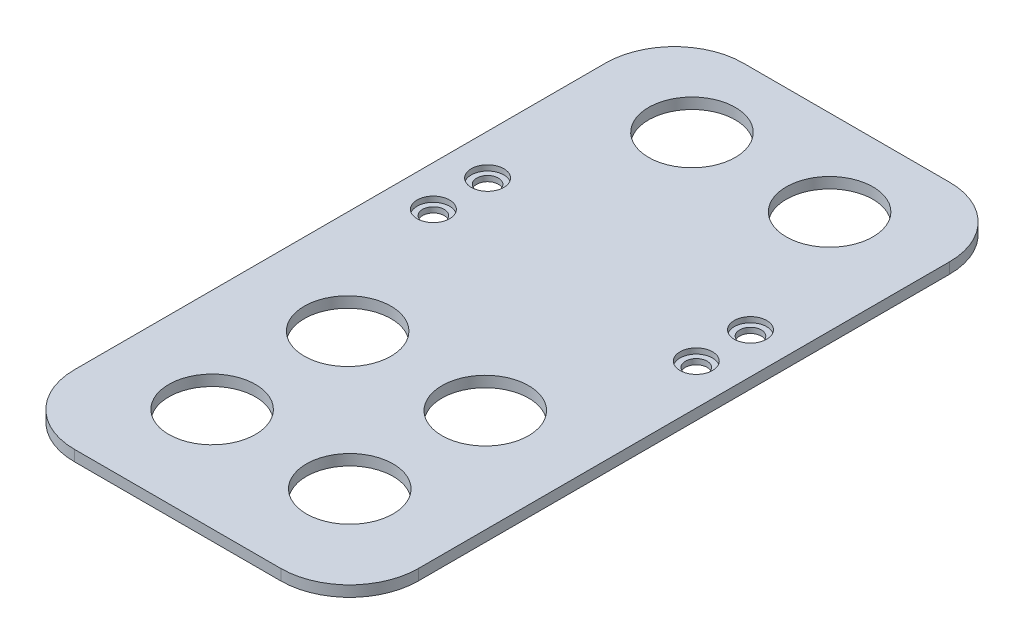
ISO-10303-21;
HEADER;
FILE_DESCRIPTION(('STEP AP214'),'2;1');
FILE_NAME('part.step','',(''),(''),'','','');
FILE_SCHEMA(('AUTOMOTIVE_DESIGN { 1 0 10303 214 1 1 1 1 }'));
ENDSEC;
DATA;
#1=APPLICATION_CONTEXT('core data for automotive mechanical design processes');
#2=APPLICATION_PROTOCOL_DEFINITION('international standard','automotive_design',2000,#1);
#3=PRODUCT_CONTEXT('',#1,'mechanical');
#4=PRODUCT('Part','Part','',(#3));
#5=PRODUCT_RELATED_PRODUCT_CATEGORY('part','',(#4));
#6=PRODUCT_DEFINITION_FORMATION('','',#4);
#7=PRODUCT_DEFINITION_CONTEXT('part definition',#1,'design');
#8=PRODUCT_DEFINITION('design','',#6,#7);
#9=PRODUCT_DEFINITION_SHAPE('','',#8);
#10=(LENGTH_UNIT() NAMED_UNIT(*) SI_UNIT(.MILLI.,.METRE.));
#11=(NAMED_UNIT(*) PLANE_ANGLE_UNIT() SI_UNIT($,.RADIAN.));
#12=(NAMED_UNIT(*) SI_UNIT($,.STERADIAN.) SOLID_ANGLE_UNIT());
#13=UNCERTAINTY_MEASURE_WITH_UNIT(LENGTH_MEASURE(1.E-05),#10,'distance_accuracy_value','');
#14=(GEOMETRIC_REPRESENTATION_CONTEXT(3) GLOBAL_UNCERTAINTY_ASSIGNED_CONTEXT((#13)) GLOBAL_UNIT_ASSIGNED_CONTEXT((#10,
#11,#12)) REPRESENTATION_CONTEXT('',''));
#15=CARTESIAN_POINT('',(0.,0.,0.));
#16=DIRECTION('',(0.,0.,1.));
#17=DIRECTION('',(1.,0.,0.));
#18=AXIS2_PLACEMENT_3D('',#15,#16,#17);
#19=CARTESIAN_POINT('',(24.26,2.,-9.75000000000002));
#20=DIRECTION('',(0.,-1.,0.));
#21=DIRECTION('',(0.,0.,-1.));
#22=AXIS2_PLACEMENT_3D('',#19,#20,#21);
#23=CYLINDRICAL_SURFACE('',#22,2.);
#24=CARTESIAN_POINT('',(24.26,0.,-9.75000000000002));
#25=DIRECTION('',(0.,1.,0.));
#26=DIRECTION('',(0.,0.,1.));
#27=AXIS2_PLACEMENT_3D('',#24,#25,#26);
#28=CIRCLE('',#27,2.);
#29=CARTESIAN_POINT('',(24.26,0.,-7.75000000000002));
#30=VERTEX_POINT('',#29);
#31=EDGE_CURVE('E164',#30,#30,#28,.T.);
#32=ORIENTED_EDGE('',*,*,#31,.F.);
#33=EDGE_LOOP('',(#32));
#34=FACE_BOUND('',#33,.T.);
#35=CARTESIAN_POINT('',(24.26,1.,-9.75000000000002));
#36=DIRECTION('',(0.,1.,0.));
#37=DIRECTION('',(0.,0.,1.));
#38=AXIS2_PLACEMENT_3D('',#35,#36,#37);
#39=CIRCLE('',#38,2.);
#40=CARTESIAN_POINT('',(24.26,1.,-7.75000000000002));
#41=VERTEX_POINT('',#40);
#42=EDGE_CURVE('E38',#41,#41,#39,.T.);
#43=ORIENTED_EDGE('',*,*,#42,.T.);
#44=EDGE_LOOP('',(#43));
#45=FACE_BOUND('',#44,.T.);
#46=ADVANCED_FACE('F34',(#34,#45),#23,.F.);
#47=CARTESIAN_POINT('',(24.26,2.,-19.75));
#48=DIRECTION('',(0.,-1.,0.));
#49=DIRECTION('',(0.,0.,-1.));
#50=AXIS2_PLACEMENT_3D('',#47,#48,#49);
#51=CYLINDRICAL_SURFACE('',#50,2.00000000000001);
#52=CARTESIAN_POINT('',(24.26,0.,-19.75));
#53=DIRECTION('',(0.,1.,0.));
#54=DIRECTION('',(0.,0.,1.));
#55=AXIS2_PLACEMENT_3D('',#52,#53,#54);
#56=CIRCLE('',#55,2.00000000000001);
#57=CARTESIAN_POINT('',(24.26,0.,-17.75));
#58=VERTEX_POINT('',#57);
#59=EDGE_CURVE('E197',#58,#58,#56,.T.);
#60=ORIENTED_EDGE('',*,*,#59,.F.);
#61=EDGE_LOOP('',(#60));
#62=FACE_BOUND('',#61,.T.);
#63=CARTESIAN_POINT('',(24.26,1.,-19.75));
#64=DIRECTION('',(0.,1.,0.));
#65=DIRECTION('',(0.,0.,1.));
#66=AXIS2_PLACEMENT_3D('',#63,#64,#65);
#67=CIRCLE('',#66,2.00000000000001);
#68=CARTESIAN_POINT('',(24.26,1.,-17.75));
#69=VERTEX_POINT('',#68);
#70=EDGE_CURVE('E170',#69,#69,#67,.T.);
#71=ORIENTED_EDGE('',*,*,#70,.T.);
#72=EDGE_LOOP('',(#71));
#73=FACE_BOUND('',#72,.T.);
#74=ADVANCED_FACE('F278',(#62,#73),#51,.F.);
#75=CARTESIAN_POINT('',(-24.26,2.,-9.75000000000001));
#76=DIRECTION('',(0.,-1.,0.));
#77=DIRECTION('',(0.,0.,-1.));
#78=AXIS2_PLACEMENT_3D('',#75,#76,#77);
#79=CYLINDRICAL_SURFACE('',#78,2.);
#80=CARTESIAN_POINT('',(-24.26,0.,-9.75000000000001));
#81=DIRECTION('',(0.,1.,0.));
#82=DIRECTION('',(0.,0.,1.));
#83=AXIS2_PLACEMENT_3D('',#80,#81,#82);
#84=CIRCLE('',#83,2.);
#85=CARTESIAN_POINT('',(-24.26,0.,-7.75));
#86=VERTEX_POINT('',#85);
#87=EDGE_CURVE('E200',#86,#86,#84,.T.);
#88=ORIENTED_EDGE('',*,*,#87,.F.);
#89=EDGE_LOOP('',(#88));
#90=FACE_BOUND('',#89,.T.);
#91=CARTESIAN_POINT('',(-24.26,1.,-9.75000000000001));
#92=DIRECTION('',(0.,1.,0.));
#93=DIRECTION('',(0.,0.,1.));
#94=AXIS2_PLACEMENT_3D('',#91,#92,#93);
#95=CIRCLE('',#94,2.);
#96=CARTESIAN_POINT('',(-24.26,1.,-7.75));
#97=VERTEX_POINT('',#96);
#98=EDGE_CURVE('E166',#97,#97,#95,.T.);
#99=ORIENTED_EDGE('',*,*,#98,.T.);
#100=EDGE_LOOP('',(#99));
#101=FACE_BOUND('',#100,.T.);
#102=ADVANCED_FACE('F284',(#90,#101),#79,.F.);
#103=CARTESIAN_POINT('',(-24.26,2.,-19.75));
#104=DIRECTION('',(0.,-1.,0.));
#105=DIRECTION('',(0.,0.,-1.));
#106=AXIS2_PLACEMENT_3D('',#103,#104,#105);
#107=CYLINDRICAL_SURFACE('',#106,2.);
#108=CARTESIAN_POINT('',(-24.26,0.,-19.75));
#109=DIRECTION('',(0.,1.,0.));
#110=DIRECTION('',(0.,0.,1.));
#111=AXIS2_PLACEMENT_3D('',#108,#109,#110);
#112=CIRCLE('',#111,2.);
#113=CARTESIAN_POINT('',(-24.26,0.,-17.75));
#114=VERTEX_POINT('',#113);
#115=EDGE_CURVE('E203',#114,#114,#112,.T.);
#116=ORIENTED_EDGE('',*,*,#115,.F.);
#117=EDGE_LOOP('',(#116));
#118=FACE_BOUND('',#117,.T.);
#119=CARTESIAN_POINT('',(-24.26,1.,-19.75));
#120=DIRECTION('',(0.,1.,0.));
#121=DIRECTION('',(0.,0.,1.));
#122=AXIS2_PLACEMENT_3D('',#119,#120,#121);
#123=CIRCLE('',#122,2.);
#124=CARTESIAN_POINT('',(-24.26,1.,-17.75));
#125=VERTEX_POINT('',#124);
#126=EDGE_CURVE('E161',#125,#125,#123,.T.);
#127=ORIENTED_EDGE('',*,*,#126,.T.);
#128=EDGE_LOOP('',(#127));
#129=FACE_BOUND('',#128,.T.);
#130=ADVANCED_FACE('F295',(#118,#129),#107,.F.);
#131=CARTESIAN_POINT('',(-19.05,2.,-49.02));
#132=DIRECTION('',(0.,1.,0.));
#133=DIRECTION('',(0.,0.,1.));
#134=AXIS2_PLACEMENT_3D('',#131,#132,#133);
#135=PLANE('',#134);
#136=CARTESIAN_POINT('',(24.26,2.,-9.75000000000002));
#137=DIRECTION('',(0.,1.,0.));
#138=DIRECTION('',(0.,0.,1.));
#139=AXIS2_PLACEMENT_3D('',#136,#137,#138);
#140=CIRCLE('',#139,3.);
#141=CARTESIAN_POINT('',(24.26,2.,-6.75000000000002));
#142=VERTEX_POINT('',#141);
#143=EDGE_CURVE('E186',#142,#142,#140,.T.);
#144=ORIENTED_EDGE('',*,*,#143,.F.);
#145=EDGE_LOOP('',(#144));
#146=FACE_BOUND('',#145,.T.);
#147=CARTESIAN_POINT('',(24.26,2.,-19.75));
#148=DIRECTION('',(0.,1.,0.));
#149=DIRECTION('',(0.,0.,1.));
#150=AXIS2_PLACEMENT_3D('',#147,#148,#149);
#151=CIRCLE('',#150,3.);
#152=CARTESIAN_POINT('',(24.26,2.,-16.75));
#153=VERTEX_POINT('',#152);
#154=EDGE_CURVE('E179',#153,#153,#151,.T.);
#155=ORIENTED_EDGE('',*,*,#154,.F.);
#156=EDGE_LOOP('',(#155));
#157=FACE_BOUND('',#156,.T.);
#158=CARTESIAN_POINT('',(-24.26,2.,-9.75000000000001));
#159=DIRECTION('',(0.,1.,0.));
#160=DIRECTION('',(0.,0.,1.));
#161=AXIS2_PLACEMENT_3D('',#158,#159,#160);
#162=CIRCLE('',#161,3.);
#163=CARTESIAN_POINT('',(-24.26,2.,-6.75));
#164=VERTEX_POINT('',#163);
#165=EDGE_CURVE('E172',#164,#164,#162,.T.);
#166=ORIENTED_EDGE('',*,*,#165,.F.);
#167=EDGE_LOOP('',(#166));
#168=FACE_BOUND('',#167,.T.);
#169=CARTESIAN_POINT('',(-24.26,2.,-19.75));
#170=DIRECTION('',(0.,1.,0.));
#171=DIRECTION('',(0.,0.,1.));
#172=AXIS2_PLACEMENT_3D('',#169,#170,#171);
#173=CIRCLE('',#172,3.);
#174=CARTESIAN_POINT('',(-24.26,2.,-16.75));
#175=VERTEX_POINT('',#174);
#176=EDGE_CURVE('E168',#175,#175,#173,.T.);
#177=ORIENTED_EDGE('',*,*,#176,.F.);
#178=EDGE_LOOP('',(#177));
#179=FACE_BOUND('',#178,.T.);
#180=CARTESIAN_POINT('',(12.7,2.,17.63));
#181=DIRECTION('',(0.,1.,0.));
#182=DIRECTION('',(0.,0.,1.));
#183=AXIS2_PLACEMENT_3D('',#180,#181,#182);
#184=CIRCLE('',#183,8.);
#185=CARTESIAN_POINT('',(12.7,2.,25.63));
#186=VERTEX_POINT('',#185);
#187=EDGE_CURVE('E213',#186,#186,#184,.T.);
#188=ORIENTED_EDGE('',*,*,#187,.F.);
#189=EDGE_LOOP('',(#188));
#190=FACE_BOUND('',#189,.T.);
#191=CARTESIAN_POINT('',(-12.7,2.,42.64));
#192=DIRECTION('',(0.,1.,0.));
#193=DIRECTION('',(0.,0.,1.));
#194=AXIS2_PLACEMENT_3D('',#191,#192,#193);
#195=CIRCLE('',#194,8.);
#196=CARTESIAN_POINT('',(-12.7,2.,50.64));
#197=VERTEX_POINT('',#196);
#198=EDGE_CURVE('E225',#197,#197,#195,.T.);
#199=ORIENTED_EDGE('',*,*,#198,.F.);
#200=EDGE_LOOP('',(#199));
#201=FACE_BOUND('',#200,.T.);
#202=CARTESIAN_POINT('',(-12.7,2.,-45.91));
#203=DIRECTION('',(0.,1.,0.));
#204=DIRECTION('',(0.,0.,1.));
#205=AXIS2_PLACEMENT_3D('',#202,#203,#204);
#206=CIRCLE('',#205,8.);
#207=CARTESIAN_POINT('',(-12.7,2.,-37.91));
#208=VERTEX_POINT('',#207);
#209=EDGE_CURVE('E138',#208,#208,#206,.T.);
#210=ORIENTED_EDGE('',*,*,#209,.F.);
#211=EDGE_LOOP('',(#210));
#212=FACE_BOUND('',#211,.T.);
#213=CARTESIAN_POINT('',(-19.05,2.,-49.02));
#214=DIRECTION('',(0.,1.,0.));
#215=DIRECTION('',(0.,0.,1.));
#216=AXIS2_PLACEMENT_3D('',#213,#214,#215);
#217=CIRCLE('',#216,12.7);
#218=CARTESIAN_POINT('',(-19.0499999999999,2.,-61.72));
#219=VERTEX_POINT('',#218);
#220=CARTESIAN_POINT('',(-31.75,2.,-49.0199999999999));
#221=VERTEX_POINT('',#220);
#222=EDGE_CURVE('E149',#219,#221,#217,.T.);
#223=ORIENTED_EDGE('',*,*,#222,.T.);
#224=DIRECTION('',(0.,0.,1.));
#225=VECTOR('',#224,1.);
#226=CARTESIAN_POINT('',(-31.75,2.,49.0199999999999));
#227=LINE('',#226,#225);
#228=CARTESIAN_POINT('',(-31.75,2.,49.0199999999999));
#229=VERTEX_POINT('',#228);
#230=EDGE_CURVE('E96',#221,#229,#227,.T.);
#231=ORIENTED_EDGE('',*,*,#230,.T.);
#232=CARTESIAN_POINT('',(-19.05,2.,49.02));
#233=DIRECTION('',(0.,1.,0.));
#234=DIRECTION('',(0.,0.,-1.));
#235=AXIS2_PLACEMENT_3D('',#232,#233,#234);
#236=CIRCLE('',#235,12.7);
#237=CARTESIAN_POINT('',(-19.0499999999999,2.,61.72));
#238=VERTEX_POINT('',#237);
#239=EDGE_CURVE('E243',#229,#238,#236,.T.);
#240=ORIENTED_EDGE('',*,*,#239,.T.);
#241=DIRECTION('',(1.,0.,0.));
#242=VECTOR('',#241,1.);
#243=CARTESIAN_POINT('',(19.0499999999999,2.,61.72));
#244=LINE('',#243,#242);
#245=CARTESIAN_POINT('',(19.0499999999999,2.,61.72));
#246=VERTEX_POINT('',#245);
#247=EDGE_CURVE('E245',#238,#246,#244,.T.);
#248=ORIENTED_EDGE('',*,*,#247,.T.);
#249=CARTESIAN_POINT('',(19.05,2.,49.02));
#250=DIRECTION('',(0.,1.,0.));
#251=DIRECTION('',(0.,0.,-1.));
#252=AXIS2_PLACEMENT_3D('',#249,#250,#251);
#253=CIRCLE('',#252,12.7);
#254=CARTESIAN_POINT('',(31.75,2.,49.0199999999999));
#255=VERTEX_POINT('',#254);
#256=EDGE_CURVE('E116',#246,#255,#253,.T.);
#257=ORIENTED_EDGE('',*,*,#256,.T.);
#258=DIRECTION('',(0.,0.,-1.));
#259=VECTOR('',#258,1.);
#260=CARTESIAN_POINT('',(31.75,2.,49.0199999999999));
#261=LINE('',#260,#259);
#262=CARTESIAN_POINT('',(31.75,2.,-49.0199999999999));
#263=VERTEX_POINT('',#262);
#264=EDGE_CURVE('E109',#255,#263,#261,.T.);
#265=ORIENTED_EDGE('',*,*,#264,.T.);
#266=CARTESIAN_POINT('',(19.05,2.,-49.02));
#267=DIRECTION('',(0.,1.,0.));
#268=DIRECTION('',(0.,0.,1.));
#269=AXIS2_PLACEMENT_3D('',#266,#267,#268);
#270=CIRCLE('',#269,12.7);
#271=CARTESIAN_POINT('',(19.0499999999999,2.,-61.72));
#272=VERTEX_POINT('',#271);
#273=EDGE_CURVE('E114',#263,#272,#270,.T.);
#274=ORIENTED_EDGE('',*,*,#273,.T.);
#275=DIRECTION('',(-1.,0.,0.));
#276=VECTOR('',#275,1.);
#277=CARTESIAN_POINT('',(19.0499999999999,2.,-61.72));
#278=LINE('',#277,#276);
#279=EDGE_CURVE('E53',#272,#219,#278,.T.);
#280=ORIENTED_EDGE('',*,*,#279,.T.);
#281=EDGE_LOOP('',(#223,#231,#240,#248,#257,#265,#274,#280));
#282=FACE_BOUND('',#281,.T.);
#283=CARTESIAN_POINT('',(12.7,2.,-45.91));
#284=DIRECTION('',(0.,1.,0.));
#285=DIRECTION('',(0.,0.,1.));
#286=AXIS2_PLACEMENT_3D('',#283,#284,#285);
#287=CIRCLE('',#286,8.);
#288=CARTESIAN_POINT('',(12.7,2.,-37.91));
#289=VERTEX_POINT('',#288);
#290=EDGE_CURVE('E231',#289,#289,#287,.T.);
#291=ORIENTED_EDGE('',*,*,#290,.F.);
#292=EDGE_LOOP('',(#291));
#293=FACE_BOUND('',#292,.T.);
#294=CARTESIAN_POINT('',(12.7,2.,42.64));
#295=DIRECTION('',(0.,1.,0.));
#296=DIRECTION('',(0.,0.,1.));
#297=AXIS2_PLACEMENT_3D('',#294,#295,#296);
#298=CIRCLE('',#297,8.);
#299=CARTESIAN_POINT('',(12.7,2.,50.64));
#300=VERTEX_POINT('',#299);
#301=EDGE_CURVE('E219',#300,#300,#298,.T.);
#302=ORIENTED_EDGE('',*,*,#301,.F.);
#303=EDGE_LOOP('',(#302));
#304=FACE_BOUND('',#303,.T.);
#305=CARTESIAN_POINT('',(-12.7,2.,17.63));
#306=DIRECTION('',(0.,1.,0.));
#307=DIRECTION('',(0.,0.,1.));
#308=AXIS2_PLACEMENT_3D('',#305,#306,#307);
#309=CIRCLE('',#308,8.);
#310=CARTESIAN_POINT('',(-12.7,2.,25.63));
#311=VERTEX_POINT('',#310);
#312=EDGE_CURVE('E207',#311,#311,#309,.T.);
#313=ORIENTED_EDGE('',*,*,#312,.F.);
#314=EDGE_LOOP('',(#313));
#315=FACE_BOUND('',#314,.T.);
#316=ADVANCED_FACE('F111',(#146,#157,#168,#179,#190,#201,#212,#282,#293,#304,#315),#135,.T.);
#317=CARTESIAN_POINT('',(-19.05,0.,-49.02));
#318=DIRECTION('',(0.,1.,0.));
#319=DIRECTION('',(0.,0.,1.));
#320=AXIS2_PLACEMENT_3D('',#317,#318,#319);
#321=PLANE('',#320);
#322=ORIENTED_EDGE('',*,*,#59,.T.);
#323=EDGE_LOOP('',(#322));
#324=FACE_BOUND('',#323,.T.);
#325=ORIENTED_EDGE('',*,*,#115,.T.);
#326=EDGE_LOOP('',(#325));
#327=FACE_BOUND('',#326,.T.);
#328=CARTESIAN_POINT('',(12.7,0.,17.63));
#329=DIRECTION('',(0.,1.,0.));
#330=DIRECTION('',(0.,0.,1.));
#331=AXIS2_PLACEMENT_3D('',#328,#329,#330);
#332=CIRCLE('',#331,8.);
#333=CARTESIAN_POINT('',(12.7,0.,25.63));
#334=VERTEX_POINT('',#333);
#335=EDGE_CURVE('E210',#334,#334,#332,.T.);
#336=ORIENTED_EDGE('',*,*,#335,.T.);
#337=EDGE_LOOP('',(#336));
#338=FACE_BOUND('',#337,.T.);
#339=CARTESIAN_POINT('',(-12.7,0.,42.64));
#340=DIRECTION('',(0.,1.,0.));
#341=DIRECTION('',(0.,0.,1.));
#342=AXIS2_PLACEMENT_3D('',#339,#340,#341);
#343=CIRCLE('',#342,8.);
#344=CARTESIAN_POINT('',(-12.7,0.,50.64));
#345=VERTEX_POINT('',#344);
#346=EDGE_CURVE('E222',#345,#345,#343,.T.);
#347=ORIENTED_EDGE('',*,*,#346,.T.);
#348=EDGE_LOOP('',(#347));
#349=FACE_BOUND('',#348,.T.);
#350=CARTESIAN_POINT('',(-12.7,0.,-45.91));
#351=DIRECTION('',(0.,1.,0.));
#352=DIRECTION('',(0.,0.,1.));
#353=AXIS2_PLACEMENT_3D('',#350,#351,#352);
#354=CIRCLE('',#353,8.);
#355=CARTESIAN_POINT('',(-12.7,0.,-37.91));
#356=VERTEX_POINT('',#355);
#357=EDGE_CURVE('E234',#356,#356,#354,.T.);
#358=ORIENTED_EDGE('',*,*,#357,.T.);
#359=EDGE_LOOP('',(#358));
#360=FACE_BOUND('',#359,.T.);
#361=CARTESIAN_POINT('',(-19.05,0.,-49.02));
#362=DIRECTION('',(0.,1.,0.));
#363=DIRECTION('',(0.,0.,1.));
#364=AXIS2_PLACEMENT_3D('',#361,#362,#363);
#365=CIRCLE('',#364,12.7);
#366=CARTESIAN_POINT('',(-19.0499999999999,0.,-61.72));
#367=VERTEX_POINT('',#366);
#368=CARTESIAN_POINT('',(-31.75,0.,-49.0199999999999));
#369=VERTEX_POINT('',#368);
#370=EDGE_CURVE('E134',#367,#369,#365,.T.);
#371=ORIENTED_EDGE('',*,*,#370,.F.);
#372=DIRECTION('',(-1.,0.,0.));
#373=VECTOR('',#372,1.);
#374=CARTESIAN_POINT('',(19.0499999999999,0.,-61.72));
#375=LINE('',#374,#373);
#376=CARTESIAN_POINT('',(19.0499999999999,0.,-61.72));
#377=VERTEX_POINT('',#376);
#378=EDGE_CURVE('E88',#377,#367,#375,.T.);
#379=ORIENTED_EDGE('',*,*,#378,.F.);
#380=CARTESIAN_POINT('',(19.05,0.,-49.02));
#381=DIRECTION('',(0.,1.,0.));
#382=DIRECTION('',(0.,0.,1.));
#383=AXIS2_PLACEMENT_3D('',#380,#381,#382);
#384=CIRCLE('',#383,12.7);
#385=CARTESIAN_POINT('',(31.75,0.,-49.0199999999999));
#386=VERTEX_POINT('',#385);
#387=EDGE_CURVE('E82',#386,#377,#384,.T.);
#388=ORIENTED_EDGE('',*,*,#387,.F.);
#389=DIRECTION('',(0.,0.,-1.));
#390=VECTOR('',#389,1.);
#391=CARTESIAN_POINT('',(31.75,0.,49.0199999999999));
#392=LINE('',#391,#390);
#393=CARTESIAN_POINT('',(31.75,0.,49.0199999999999));
#394=VERTEX_POINT('',#393);
#395=EDGE_CURVE('E124',#394,#386,#392,.T.);
#396=ORIENTED_EDGE('',*,*,#395,.F.);
#397=CARTESIAN_POINT('',(19.05,0.,49.02));
#398=DIRECTION('',(0.,1.,0.));
#399=DIRECTION('',(0.,0.,-1.));
#400=AXIS2_PLACEMENT_3D('',#397,#398,#399);
#401=CIRCLE('',#400,12.7);
#402=CARTESIAN_POINT('',(19.0499999999999,0.,61.72));
#403=VERTEX_POINT('',#402);
#404=EDGE_CURVE('E144',#403,#394,#401,.T.);
#405=ORIENTED_EDGE('',*,*,#404,.F.);
#406=DIRECTION('',(1.,0.,0.));
#407=VECTOR('',#406,1.);
#408=CARTESIAN_POINT('',(19.0499999999999,0.,61.72));
#409=LINE('',#408,#407);
#410=CARTESIAN_POINT('',(-19.0499999999999,0.,61.72));
#411=VERTEX_POINT('',#410);
#412=EDGE_CURVE('E142',#411,#403,#409,.T.);
#413=ORIENTED_EDGE('',*,*,#412,.F.);
#414=CARTESIAN_POINT('',(-19.05,0.,49.02));
#415=DIRECTION('',(0.,1.,0.));
#416=DIRECTION('',(0.,0.,-1.));
#417=AXIS2_PLACEMENT_3D('',#414,#415,#416);
#418=CIRCLE('',#417,12.7);
#419=CARTESIAN_POINT('',(-31.75,0.,49.0199999999999));
#420=VERTEX_POINT('',#419);
#421=EDGE_CURVE('E140',#420,#411,#418,.T.);
#422=ORIENTED_EDGE('',*,*,#421,.F.);
#423=DIRECTION('',(0.,0.,1.));
#424=VECTOR('',#423,1.);
#425=CARTESIAN_POINT('',(-31.75,0.,49.0199999999999));
#426=LINE('',#425,#424);
#427=EDGE_CURVE('E137',#369,#420,#426,.T.);
#428=ORIENTED_EDGE('',*,*,#427,.F.);
#429=EDGE_LOOP('',(#371,#379,#388,#396,#405,#413,#422,#428));
#430=FACE_BOUND('',#429,.T.);
#431=CARTESIAN_POINT('',(12.7,0.,-45.91));
#432=DIRECTION('',(0.,1.,0.));
#433=DIRECTION('',(0.,0.,1.));
#434=AXIS2_PLACEMENT_3D('',#431,#432,#433);
#435=CIRCLE('',#434,8.);
#436=CARTESIAN_POINT('',(12.7,0.,-37.91));
#437=VERTEX_POINT('',#436);
#438=EDGE_CURVE('E228',#437,#437,#435,.T.);
#439=ORIENTED_EDGE('',*,*,#438,.T.);
#440=EDGE_LOOP('',(#439));
#441=FACE_BOUND('',#440,.T.);
#442=CARTESIAN_POINT('',(12.7,0.,42.64));
#443=DIRECTION('',(0.,1.,0.));
#444=DIRECTION('',(0.,0.,1.));
#445=AXIS2_PLACEMENT_3D('',#442,#443,#444);
#446=CIRCLE('',#445,8.);
#447=CARTESIAN_POINT('',(12.7,0.,50.64));
#448=VERTEX_POINT('',#447);
#449=EDGE_CURVE('E216',#448,#448,#446,.T.);
#450=ORIENTED_EDGE('',*,*,#449,.T.);
#451=EDGE_LOOP('',(#450));
#452=FACE_BOUND('',#451,.T.);
#453=CARTESIAN_POINT('',(-12.7,0.,17.63));
#454=DIRECTION('',(0.,1.,0.));
#455=DIRECTION('',(0.,0.,1.));
#456=AXIS2_PLACEMENT_3D('',#453,#454,#455);
#457=CIRCLE('',#456,8.);
#458=CARTESIAN_POINT('',(-12.7,0.,25.63));
#459=VERTEX_POINT('',#458);
#460=EDGE_CURVE('E206',#459,#459,#457,.T.);
#461=ORIENTED_EDGE('',*,*,#460,.T.);
#462=EDGE_LOOP('',(#461));
#463=FACE_BOUND('',#462,.T.);
#464=ORIENTED_EDGE('',*,*,#87,.T.);
#465=EDGE_LOOP('',(#464));
#466=FACE_BOUND('',#465,.T.);
#467=ORIENTED_EDGE('',*,*,#31,.T.);
#468=EDGE_LOOP('',(#467));
#469=FACE_BOUND('',#468,.T.);
#470=ADVANCED_FACE('F258',(#324,#327,#338,#349,#360,#430,#441,#452,#463,#466,#469),#321,.F.);
#471=CARTESIAN_POINT('',(-19.05,2.,-49.02));
#472=DIRECTION('',(0.,-1.,0.));
#473=DIRECTION('',(0.,0.,-1.));
#474=AXIS2_PLACEMENT_3D('',#471,#472,#473);
#475=CYLINDRICAL_SURFACE('',#474,12.7);
#476=ORIENTED_EDGE('',*,*,#370,.T.);
#477=DIRECTION('',(0.,-1.,0.));
#478=VECTOR('',#477,1.);
#479=CARTESIAN_POINT('',(-31.75,2.,-49.0199999999999));
#480=LINE('',#479,#478);
#481=EDGE_CURVE('E11',#221,#369,#480,.T.);
#482=ORIENTED_EDGE('',*,*,#481,.F.);
#483=ORIENTED_EDGE('',*,*,#222,.F.);
#484=DIRECTION('',(0.,-1.,0.));
#485=VECTOR('',#484,1.);
#486=CARTESIAN_POINT('',(-19.0499999999999,2.,-61.72));
#487=LINE('',#486,#485);
#488=EDGE_CURVE('E130',#219,#367,#487,.T.);
#489=ORIENTED_EDGE('',*,*,#488,.T.);
#490=EDGE_LOOP('',(#476,#482,#483,#489));
#491=FACE_BOUND('',#490,.T.);
#492=ADVANCED_FACE('F36',(#491),#475,.T.);
#493=CARTESIAN_POINT('',(-31.75,2.,49.0199999999999));
#494=DIRECTION('',(1.,0.,0.));
#495=DIRECTION('',(0.,0.,-1.));
#496=AXIS2_PLACEMENT_3D('',#493,#494,#495);
#497=PLANE('',#496);
#498=ORIENTED_EDGE('',*,*,#427,.T.);
#499=DIRECTION('',(0.,-1.,0.));
#500=VECTOR('',#499,1.);
#501=CARTESIAN_POINT('',(-31.75,2.,49.0199999999999));
#502=LINE('',#501,#500);
#503=EDGE_CURVE('E44',#229,#420,#502,.T.);
#504=ORIENTED_EDGE('',*,*,#503,.F.);
#505=ORIENTED_EDGE('',*,*,#230,.F.);
#506=ORIENTED_EDGE('',*,*,#481,.T.);
#507=EDGE_LOOP('',(#498,#504,#505,#506));
#508=FACE_BOUND('',#507,.T.);
#509=ADVANCED_FACE('F326',(#508),#497,.F.);
#510=CARTESIAN_POINT('',(-19.05,2.,49.02));
#511=DIRECTION('',(0.,-1.,0.));
#512=DIRECTION('',(0.,0.,-1.));
#513=AXIS2_PLACEMENT_3D('',#510,#511,#512);
#514=CYLINDRICAL_SURFACE('',#513,12.7);
#515=ORIENTED_EDGE('',*,*,#421,.T.);
#516=DIRECTION('',(0.,-1.,0.));
#517=VECTOR('',#516,1.);
#518=CARTESIAN_POINT('',(-19.0499999999999,2.,61.72));
#519=LINE('',#518,#517);
#520=EDGE_CURVE('E156',#238,#411,#519,.T.);
#521=ORIENTED_EDGE('',*,*,#520,.F.);
#522=ORIENTED_EDGE('',*,*,#239,.F.);
#523=ORIENTED_EDGE('',*,*,#503,.T.);
#524=EDGE_LOOP('',(#515,#521,#522,#523));
#525=FACE_BOUND('',#524,.T.);
#526=ADVANCED_FACE('F509',(#525),#514,.T.);
#527=CARTESIAN_POINT('',(19.0499999999999,2.,61.72));
#528=DIRECTION('',(0.,0.,-1.));
#529=DIRECTION('',(-1.,0.,0.));
#530=AXIS2_PLACEMENT_3D('',#527,#528,#529);
#531=PLANE('',#530);
#532=ORIENTED_EDGE('',*,*,#412,.T.);
#533=DIRECTION('',(0.,-1.,0.));
#534=VECTOR('',#533,1.);
#535=CARTESIAN_POINT('',(19.0499999999999,2.,61.72));
#536=LINE('',#535,#534);
#537=EDGE_CURVE('E153',#246,#403,#536,.T.);
#538=ORIENTED_EDGE('',*,*,#537,.F.);
#539=ORIENTED_EDGE('',*,*,#247,.F.);
#540=ORIENTED_EDGE('',*,*,#520,.T.);
#541=EDGE_LOOP('',(#532,#538,#539,#540));
#542=FACE_BOUND('',#541,.T.);
#543=ADVANCED_FACE('F251',(#542),#531,.F.);
#544=CARTESIAN_POINT('',(19.05,2.,49.02));
#545=DIRECTION('',(0.,-1.,0.));
#546=DIRECTION('',(0.,0.,-1.));
#547=AXIS2_PLACEMENT_3D('',#544,#545,#546);
#548=CYLINDRICAL_SURFACE('',#547,12.7);
#549=ORIENTED_EDGE('',*,*,#404,.T.);
#550=DIRECTION('',(0.,-1.,0.));
#551=VECTOR('',#550,1.);
#552=CARTESIAN_POINT('',(31.75,2.,49.0199999999999));
#553=LINE('',#552,#551);
#554=EDGE_CURVE('E125',#255,#394,#553,.T.);
#555=ORIENTED_EDGE('',*,*,#554,.F.);
#556=ORIENTED_EDGE('',*,*,#256,.F.);
#557=ORIENTED_EDGE('',*,*,#537,.T.);
#558=EDGE_LOOP('',(#549,#555,#556,#557));
#559=FACE_BOUND('',#558,.T.);
#560=ADVANCED_FACE('F255',(#559),#548,.T.);
#561=CARTESIAN_POINT('',(31.75,2.,49.0199999999999));
#562=DIRECTION('',(-1.,0.,0.));
#563=DIRECTION('',(0.,0.,1.));
#564=AXIS2_PLACEMENT_3D('',#561,#562,#563);
#565=PLANE('',#564);
#566=ORIENTED_EDGE('',*,*,#395,.T.);
#567=DIRECTION('',(0.,-1.,0.));
#568=VECTOR('',#567,1.);
#569=CARTESIAN_POINT('',(31.75,2.,-49.0199999999999));
#570=LINE('',#569,#568);
#571=EDGE_CURVE('E121',#263,#386,#570,.T.);
#572=ORIENTED_EDGE('',*,*,#571,.F.);
#573=ORIENTED_EDGE('',*,*,#264,.F.);
#574=ORIENTED_EDGE('',*,*,#554,.T.);
#575=EDGE_LOOP('',(#566,#572,#573,#574));
#576=FACE_BOUND('',#575,.T.);
#577=ADVANCED_FACE('F122',(#576),#565,.F.);
#578=CARTESIAN_POINT('',(19.05,2.,-49.02));
#579=DIRECTION('',(0.,-1.,0.));
#580=DIRECTION('',(0.,0.,-1.));
#581=AXIS2_PLACEMENT_3D('',#578,#579,#580);
#582=CYLINDRICAL_SURFACE('',#581,12.7);
#583=ORIENTED_EDGE('',*,*,#387,.T.);
#584=DIRECTION('',(0.,-1.,0.));
#585=VECTOR('',#584,1.);
#586=CARTESIAN_POINT('',(19.0499999999999,2.,-61.72));
#587=LINE('',#586,#585);
#588=EDGE_CURVE('E126',#272,#377,#587,.T.);
#589=ORIENTED_EDGE('',*,*,#588,.F.);
#590=ORIENTED_EDGE('',*,*,#273,.F.);
#591=ORIENTED_EDGE('',*,*,#571,.T.);
#592=EDGE_LOOP('',(#583,#589,#590,#591));
#593=FACE_BOUND('',#592,.T.);
#594=ADVANCED_FACE('F128',(#593),#582,.T.);
#595=CARTESIAN_POINT('',(19.0499999999999,2.,-61.72));
#596=DIRECTION('',(0.,0.,1.));
#597=DIRECTION('',(1.,0.,0.));
#598=AXIS2_PLACEMENT_3D('',#595,#596,#597);
#599=PLANE('',#598);
#600=ORIENTED_EDGE('',*,*,#378,.T.);
#601=ORIENTED_EDGE('',*,*,#488,.F.);
#602=ORIENTED_EDGE('',*,*,#279,.F.);
#603=ORIENTED_EDGE('',*,*,#588,.T.);
#604=EDGE_LOOP('',(#600,#601,#602,#603));
#605=FACE_BOUND('',#604,.T.);
#606=ADVANCED_FACE('F264',(#605),#599,.F.);
#607=CARTESIAN_POINT('',(-12.7,2.,-45.91));
#608=DIRECTION('',(0.,-1.,0.));
#609=DIRECTION('',(0.,0.,-1.));
#610=AXIS2_PLACEMENT_3D('',#607,#608,#609);
#611=CYLINDRICAL_SURFACE('',#610,8.);
#612=ORIENTED_EDGE('',*,*,#209,.T.);
#613=EDGE_LOOP('',(#612));
#614=FACE_BOUND('',#613,.T.);
#615=ORIENTED_EDGE('',*,*,#357,.F.);
#616=EDGE_LOOP('',(#615));
#617=FACE_BOUND('',#616,.T.);
#618=ADVANCED_FACE('F266',(#614,#617),#611,.F.);
#619=CARTESIAN_POINT('',(12.7,2.,-45.91));
#620=DIRECTION('',(0.,-1.,0.));
#621=DIRECTION('',(0.,0.,-1.));
#622=AXIS2_PLACEMENT_3D('',#619,#620,#621);
#623=CYLINDRICAL_SURFACE('',#622,8.);
#624=ORIENTED_EDGE('',*,*,#290,.T.);
#625=EDGE_LOOP('',(#624));
#626=FACE_BOUND('',#625,.T.);
#627=ORIENTED_EDGE('',*,*,#438,.F.);
#628=EDGE_LOOP('',(#627));
#629=FACE_BOUND('',#628,.T.);
#630=ADVANCED_FACE('F272',(#626,#629),#623,.F.);
#631=CARTESIAN_POINT('',(-12.7,2.,42.64));
#632=DIRECTION('',(0.,-1.,0.));
#633=DIRECTION('',(0.,0.,-1.));
#634=AXIS2_PLACEMENT_3D('',#631,#632,#633);
#635=CYLINDRICAL_SURFACE('',#634,8.);
#636=ORIENTED_EDGE('',*,*,#198,.T.);
#637=EDGE_LOOP('',(#636));
#638=FACE_BOUND('',#637,.T.);
#639=ORIENTED_EDGE('',*,*,#346,.F.);
#640=EDGE_LOOP('',(#639));
#641=FACE_BOUND('',#640,.T.);
#642=ADVANCED_FACE('F311',(#638,#641),#635,.F.);
#643=CARTESIAN_POINT('',(12.7,2.,42.64));
#644=DIRECTION('',(0.,-1.,0.));
#645=DIRECTION('',(0.,0.,-1.));
#646=AXIS2_PLACEMENT_3D('',#643,#644,#645);
#647=CYLINDRICAL_SURFACE('',#646,8.);
#648=ORIENTED_EDGE('',*,*,#301,.T.);
#649=EDGE_LOOP('',(#648));
#650=FACE_BOUND('',#649,.T.);
#651=ORIENTED_EDGE('',*,*,#449,.F.);
#652=EDGE_LOOP('',(#651));
#653=FACE_BOUND('',#652,.T.);
#654=ADVANCED_FACE('F307',(#650,#653),#647,.F.);
#655=CARTESIAN_POINT('',(12.7,2.,17.63));
#656=DIRECTION('',(0.,-1.,0.));
#657=DIRECTION('',(0.,0.,-1.));
#658=AXIS2_PLACEMENT_3D('',#655,#656,#657);
#659=CYLINDRICAL_SURFACE('',#658,8.);
#660=ORIENTED_EDGE('',*,*,#187,.T.);
#661=EDGE_LOOP('',(#660));
#662=FACE_BOUND('',#661,.T.);
#663=ORIENTED_EDGE('',*,*,#335,.F.);
#664=EDGE_LOOP('',(#663));
#665=FACE_BOUND('',#664,.T.);
#666=ADVANCED_FACE('F303',(#662,#665),#659,.F.);
#667=CARTESIAN_POINT('',(-12.7,2.,17.63));
#668=DIRECTION('',(0.,-1.,0.));
#669=DIRECTION('',(0.,0.,-1.));
#670=AXIS2_PLACEMENT_3D('',#667,#668,#669);
#671=CYLINDRICAL_SURFACE('',#670,8.);
#672=ORIENTED_EDGE('',*,*,#312,.T.);
#673=EDGE_LOOP('',(#672));
#674=FACE_BOUND('',#673,.T.);
#675=ORIENTED_EDGE('',*,*,#460,.F.);
#676=EDGE_LOOP('',(#675));
#677=FACE_BOUND('',#676,.T.);
#678=ADVANCED_FACE('F300',(#674,#677),#671,.F.);
#679=CARTESIAN_POINT('',(-24.26,1.,-19.75));
#680=DIRECTION('',(0.,1.,0.));
#681=DIRECTION('',(0.,0.,1.));
#682=AXIS2_PLACEMENT_3D('',#679,#680,#681);
#683=CYLINDRICAL_SURFACE('',#682,3.);
#684=CARTESIAN_POINT('',(-24.26,1.,-19.75));
#685=DIRECTION('',(0.,1.,0.));
#686=DIRECTION('',(0.,0.,1.));
#687=AXIS2_PLACEMENT_3D('',#684,#685,#686);
#688=CIRCLE('',#687,3.);
#689=CARTESIAN_POINT('',(-24.26,1.,-16.75));
#690=VERTEX_POINT('',#689);
#691=EDGE_CURVE('E165',#690,#690,#688,.T.);
#692=ORIENTED_EDGE('',*,*,#691,.F.);
#693=EDGE_LOOP('',(#692));
#694=FACE_BOUND('',#693,.T.);
#695=ORIENTED_EDGE('',*,*,#176,.T.);
#696=EDGE_LOOP('',(#695));
#697=FACE_BOUND('',#696,.T.);
#698=ADVANCED_FACE('F290',(#694,#697),#683,.F.);
#699=CARTESIAN_POINT('',(-24.26,1.,-19.75));
#700=DIRECTION('',(0.,1.,0.));
#701=DIRECTION('',(0.,0.,1.));
#702=AXIS2_PLACEMENT_3D('',#699,#700,#701);
#703=PLANE('',#702);
#704=ORIENTED_EDGE('',*,*,#126,.F.);
#705=EDGE_LOOP('',(#704));
#706=FACE_BOUND('',#705,.T.);
#707=ORIENTED_EDGE('',*,*,#691,.T.);
#708=EDGE_LOOP('',(#707));
#709=FACE_BOUND('',#708,.T.);
#710=ADVANCED_FACE('F342',(#706,#709),#703,.T.);
#711=CARTESIAN_POINT('',(-24.26,1.,-9.75000000000001));
#712=DIRECTION('',(0.,1.,0.));
#713=DIRECTION('',(0.,0.,1.));
#714=AXIS2_PLACEMENT_3D('',#711,#712,#713);
#715=CYLINDRICAL_SURFACE('',#714,3.);
#716=CARTESIAN_POINT('',(-24.26,1.,-9.75000000000001));
#717=DIRECTION('',(0.,1.,0.));
#718=DIRECTION('',(0.,0.,1.));
#719=AXIS2_PLACEMENT_3D('',#716,#717,#718);
#720=CIRCLE('',#719,3.);
#721=CARTESIAN_POINT('',(-24.26,1.,-6.75));
#722=VERTEX_POINT('',#721);
#723=EDGE_CURVE('E169',#722,#722,#720,.T.);
#724=ORIENTED_EDGE('',*,*,#723,.F.);
#725=EDGE_LOOP('',(#724));
#726=FACE_BOUND('',#725,.T.);
#727=ORIENTED_EDGE('',*,*,#165,.T.);
#728=EDGE_LOOP('',(#727));
#729=FACE_BOUND('',#728,.T.);
#730=ADVANCED_FACE('F345',(#726,#729),#715,.F.);
#731=CARTESIAN_POINT('',(-24.26,1.,-9.75000000000001));
#732=DIRECTION('',(0.,1.,0.));
#733=DIRECTION('',(0.,0.,1.));
#734=AXIS2_PLACEMENT_3D('',#731,#732,#733);
#735=PLANE('',#734);
#736=ORIENTED_EDGE('',*,*,#98,.F.);
#737=EDGE_LOOP('',(#736));
#738=FACE_BOUND('',#737,.T.);
#739=ORIENTED_EDGE('',*,*,#723,.T.);
#740=EDGE_LOOP('',(#739));
#741=FACE_BOUND('',#740,.T.);
#742=ADVANCED_FACE('F373',(#738,#741),#735,.T.);
#743=CARTESIAN_POINT('',(24.26,1.,-19.75));
#744=DIRECTION('',(0.,1.,0.));
#745=DIRECTION('',(0.,0.,1.));
#746=AXIS2_PLACEMENT_3D('',#743,#744,#745);
#747=CYLINDRICAL_SURFACE('',#746,3.);
#748=CARTESIAN_POINT('',(24.26,1.,-19.75));
#749=DIRECTION('',(0.,1.,0.));
#750=DIRECTION('',(0.,0.,1.));
#751=AXIS2_PLACEMENT_3D('',#748,#749,#750);
#752=CIRCLE('',#751,3.);
#753=CARTESIAN_POINT('',(24.26,1.,-16.75));
#754=VERTEX_POINT('',#753);
#755=EDGE_CURVE('E173',#754,#754,#752,.T.);
#756=ORIENTED_EDGE('',*,*,#755,.F.);
#757=EDGE_LOOP('',(#756));
#758=FACE_BOUND('',#757,.T.);
#759=ORIENTED_EDGE('',*,*,#154,.T.);
#760=EDGE_LOOP('',(#759));
#761=FACE_BOUND('',#760,.T.);
#762=ADVANCED_FACE('F381',(#758,#761),#747,.F.);
#763=CARTESIAN_POINT('',(24.26,1.,-19.75));
#764=DIRECTION('',(0.,1.,0.));
#765=DIRECTION('',(0.,0.,1.));
#766=AXIS2_PLACEMENT_3D('',#763,#764,#765);
#767=PLANE('',#766);
#768=ORIENTED_EDGE('',*,*,#70,.F.);
#769=EDGE_LOOP('',(#768));
#770=FACE_BOUND('',#769,.T.);
#771=ORIENTED_EDGE('',*,*,#755,.T.);
#772=EDGE_LOOP('',(#771));
#773=FACE_BOUND('',#772,.T.);
#774=ADVANCED_FACE('F389',(#770,#773),#767,.T.);
#775=CARTESIAN_POINT('',(24.26,1.,-9.75000000000002));
#776=DIRECTION('',(0.,1.,0.));
#777=DIRECTION('',(0.,0.,1.));
#778=AXIS2_PLACEMENT_3D('',#775,#776,#777);
#779=CYLINDRICAL_SURFACE('',#778,3.);
#780=CARTESIAN_POINT('',(24.26,1.,-9.75000000000002));
#781=DIRECTION('',(0.,1.,0.));
#782=DIRECTION('',(0.,0.,1.));
#783=AXIS2_PLACEMENT_3D('',#780,#781,#782);
#784=CIRCLE('',#783,3.);
#785=CARTESIAN_POINT('',(24.26,1.,-6.75000000000002));
#786=VERTEX_POINT('',#785);
#787=EDGE_CURVE('E559',#786,#786,#784,.T.);
#788=ORIENTED_EDGE('',*,*,#787,.F.);
#789=EDGE_LOOP('',(#788));
#790=FACE_BOUND('',#789,.T.);
#791=ORIENTED_EDGE('',*,*,#143,.T.);
#792=EDGE_LOOP('',(#791));
#793=FACE_BOUND('',#792,.T.);
#794=ADVANCED_FACE('F397',(#790,#793),#779,.F.);
#795=CARTESIAN_POINT('',(24.26,1.,-9.75000000000002));
#796=DIRECTION('',(0.,1.,0.));
#797=DIRECTION('',(0.,0.,1.));
#798=AXIS2_PLACEMENT_3D('',#795,#796,#797);
#799=PLANE('',#798);
#800=ORIENTED_EDGE('',*,*,#42,.F.);
#801=EDGE_LOOP('',(#800));
#802=FACE_BOUND('',#801,.T.);
#803=ORIENTED_EDGE('',*,*,#787,.T.);
#804=EDGE_LOOP('',(#803));
#805=FACE_BOUND('',#804,.T.);
#806=ADVANCED_FACE('F405',(#802,#805),#799,.T.);
#807=CLOSED_SHELL('',(#46,#74,#102,#130,#316,#470,#492,#509,#526,#543,#560,#577,#594,#606,#618,
#630,#642,#654,#666,#678,#698,#710,#730,#742,#762,#774,#794,#806));
#808=MANIFOLD_SOLID_BREP('B2',#807);
#809=ADVANCED_BREP_SHAPE_REPRESENTATION('',(#18,#808),#14);
#810=SHAPE_DEFINITION_REPRESENTATION(#9,#809);
ENDSEC;
END-ISO-10303-21;
